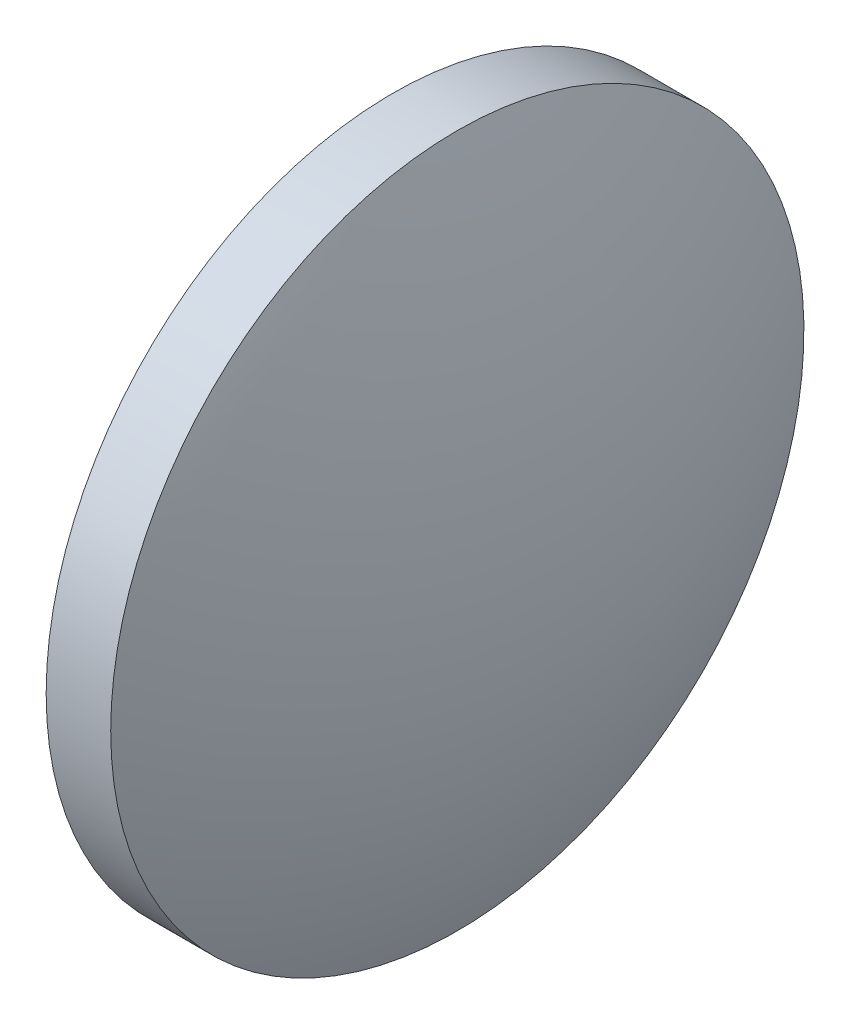
ISO-10303-21;
HEADER;
FILE_DESCRIPTION(('STEP AP214'),'2;1');
FILE_NAME('part.step','',(''),(''),'','','');
FILE_SCHEMA(('AUTOMOTIVE_DESIGN { 1 0 10303 214 1 1 1 1 }'));
ENDSEC;
DATA;
#1=APPLICATION_CONTEXT('core data for automotive mechanical design processes');
#2=APPLICATION_PROTOCOL_DEFINITION('international standard','automotive_design',2000,#1);
#3=PRODUCT_CONTEXT('',#1,'mechanical');
#4=PRODUCT('Part','Part','',(#3));
#5=PRODUCT_RELATED_PRODUCT_CATEGORY('part','',(#4));
#6=PRODUCT_DEFINITION_FORMATION('','',#4);
#7=PRODUCT_DEFINITION_CONTEXT('part definition',#1,'design');
#8=PRODUCT_DEFINITION('design','',#6,#7);
#9=PRODUCT_DEFINITION_SHAPE('','',#8);
#10=(LENGTH_UNIT() NAMED_UNIT(*) SI_UNIT(.MILLI.,.METRE.));
#11=(NAMED_UNIT(*) PLANE_ANGLE_UNIT() SI_UNIT($,.RADIAN.));
#12=(NAMED_UNIT(*) SI_UNIT($,.STERADIAN.) SOLID_ANGLE_UNIT());
#13=UNCERTAINTY_MEASURE_WITH_UNIT(LENGTH_MEASURE(1.E-05),#10,'distance_accuracy_value','');
#14=(GEOMETRIC_REPRESENTATION_CONTEXT(3) GLOBAL_UNCERTAINTY_ASSIGNED_CONTEXT((#13)) GLOBAL_UNIT_ASSIGNED_CONTEXT((#10,
#11,#12)) REPRESENTATION_CONTEXT('',''));
#15=CARTESIAN_POINT('',(0.,0.,0.));
#16=DIRECTION('',(0.,0.,1.));
#17=DIRECTION('',(1.,0.,0.));
#18=AXIS2_PLACEMENT_3D('',#15,#16,#17);
#19=CARTESIAN_POINT('',(422.6905016261,0.768155750193039,0.));
#20=DIRECTION('',(-1.,0.,0.));
#21=DIRECTION('',(0.,1.,0.));
#22=AXIS2_PLACEMENT_3D('',#19,#20,#21);
#23=SPHERICAL_SURFACE('',#22,20.6807763975155);
#24=CARTESIAN_POINT('',(441.761278023615,0.768155750193074,0.));
#25=DIRECTION('',(-1.,0.,0.));
#26=DIRECTION('',(0.,0.,1.));
#27=AXIS2_PLACEMENT_3D('',#24,#25,#26);
#28=CIRCLE('',#27,8.);
#29=CARTESIAN_POINT('',(441.761278023615,0.768155750193074,8.));
#30=VERTEX_POINT('',#29);
#31=EDGE_CURVE('E10',#30,#30,#28,.T.);
#32=ORIENTED_EDGE('',*,*,#31,.F.);
#33=EDGE_LOOP('',(#32));
#34=FACE_BOUND('',#33,.T.);
#35=ADVANCED_FACE('F35',(#34),#23,.T.);
#36=CARTESIAN_POINT('',(438.623305550624,0.768155750193074,0.));
#37=DIRECTION('',(-1.,0.,0.));
#38=DIRECTION('',(0.,0.,1.));
#39=AXIS2_PLACEMENT_3D('',#36,#37,#38);
#40=CYLINDRICAL_SURFACE('',#39,8.);
#41=CARTESIAN_POINT('',(440.271278023615,0.768155750193074,0.));
#42=DIRECTION('',(-1.,0.,0.));
#43=DIRECTION('',(0.,0.,1.));
#44=AXIS2_PLACEMENT_3D('',#41,#42,#43);
#45=CIRCLE('',#44,8.);
#46=CARTESIAN_POINT('',(440.271278023615,0.768155750193074,8.));
#47=VERTEX_POINT('',#46);
#48=EDGE_CURVE('E41',#47,#47,#45,.T.);
#49=ORIENTED_EDGE('',*,*,#48,.F.);
#50=EDGE_LOOP('',(#49));
#51=FACE_BOUND('',#50,.T.);
#52=ORIENTED_EDGE('',*,*,#31,.T.);
#53=EDGE_LOOP('',(#52));
#54=FACE_BOUND('',#53,.T.);
#55=ADVANCED_FACE('F49',(#51,#54),#40,.T.);
#56=CARTESIAN_POINT('',(440.271278023615,0.768155750193074,0.));
#57=DIRECTION('',(1.,0.,0.));
#58=DIRECTION('',(0.,0.,-1.));
#59=AXIS2_PLACEMENT_3D('',#56,#57,#58);
#60=PLANE('',#59);
#61=ORIENTED_EDGE('',*,*,#48,.T.);
#62=EDGE_LOOP('',(#61));
#63=FACE_BOUND('',#62,.T.);
#64=ADVANCED_FACE('F47',(#63),#60,.F.);
#65=CLOSED_SHELL('',(#35,#55,#64));
#66=MANIFOLD_SOLID_BREP('B2',#65);
#67=ADVANCED_BREP_SHAPE_REPRESENTATION('',(#18,#66),#14);
#68=SHAPE_DEFINITION_REPRESENTATION(#9,#67);
ENDSEC;
END-ISO-10303-21;
